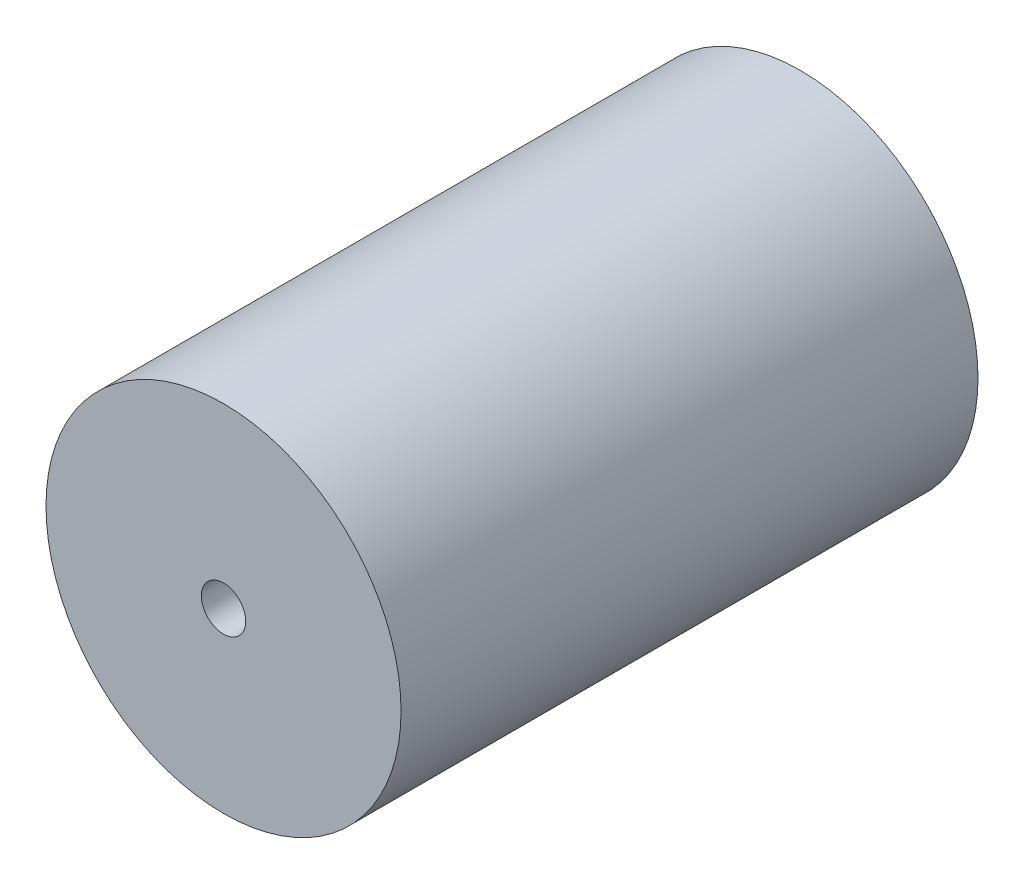
ISO-10303-21;
HEADER;
FILE_DESCRIPTION(('STEP AP214'),'2;1');
FILE_NAME('part.step','',(''),(''),'','','');
FILE_SCHEMA(('AUTOMOTIVE_DESIGN { 1 0 10303 214 1 1 1 1 }'));
ENDSEC;
DATA;
#1=APPLICATION_CONTEXT('core data for automotive mechanical design processes');
#2=APPLICATION_PROTOCOL_DEFINITION('international standard','automotive_design',2000,#1);
#3=PRODUCT_CONTEXT('',#1,'mechanical');
#4=PRODUCT('Part','Part','',(#3));
#5=PRODUCT_RELATED_PRODUCT_CATEGORY('part','',(#4));
#6=PRODUCT_DEFINITION_FORMATION('','',#4);
#7=PRODUCT_DEFINITION_CONTEXT('part definition',#1,'design');
#8=PRODUCT_DEFINITION('design','',#6,#7);
#9=PRODUCT_DEFINITION_SHAPE('','',#8);
#10=(LENGTH_UNIT() NAMED_UNIT(*) SI_UNIT(.MILLI.,.METRE.));
#11=(NAMED_UNIT(*) PLANE_ANGLE_UNIT() SI_UNIT($,.RADIAN.));
#12=(NAMED_UNIT(*) SI_UNIT($,.STERADIAN.) SOLID_ANGLE_UNIT());
#13=UNCERTAINTY_MEASURE_WITH_UNIT(LENGTH_MEASURE(1.E-05),#10,'distance_accuracy_value','');
#14=(GEOMETRIC_REPRESENTATION_CONTEXT(3) GLOBAL_UNCERTAINTY_ASSIGNED_CONTEXT((#13)) GLOBAL_UNIT_ASSIGNED_CONTEXT((#10,
#11,#12)) REPRESENTATION_CONTEXT('',''));
#15=CARTESIAN_POINT('',(0.,0.,0.));
#16=DIRECTION('',(0.,0.,1.));
#17=DIRECTION('',(1.,0.,0.));
#18=AXIS2_PLACEMENT_3D('',#15,#16,#17);
#19=CARTESIAN_POINT('',(0.,0.,0.));
#20=DIRECTION('',(0.,0.,1.));
#21=DIRECTION('',(1.,0.,0.));
#22=AXIS2_PLACEMENT_3D('',#19,#20,#21);
#23=PLANE('',#22);
#24=CARTESIAN_POINT('',(0.,0.,0.));
#25=DIRECTION('',(0.,0.,1.));
#26=DIRECTION('',(1.,0.,0.));
#27=AXIS2_PLACEMENT_3D('',#24,#25,#26);
#28=CIRCLE('',#27,4.);
#29=CARTESIAN_POINT('',(4.,0.,0.));
#30=VERTEX_POINT('',#29);
#31=EDGE_CURVE('E10',#30,#30,#28,.T.);
#32=ORIENTED_EDGE('',*,*,#31,.F.);
#33=EDGE_LOOP('',(#32));
#34=FACE_BOUND('',#33,.T.);
#35=CARTESIAN_POINT('',(0.,0.,0.));
#36=DIRECTION('',(0.,0.,1.));
#37=DIRECTION('',(1.,0.,0.));
#38=AXIS2_PLACEMENT_3D('',#35,#36,#37);
#39=CIRCLE('',#38,2.6);
#40=CARTESIAN_POINT('',(2.6,0.,0.));
#41=VERTEX_POINT('',#40);
#42=EDGE_CURVE('E38',#41,#41,#39,.T.);
#43=ORIENTED_EDGE('',*,*,#42,.T.);
#44=EDGE_LOOP('',(#43));
#45=FACE_BOUND('',#44,.T.);
#46=ADVANCED_FACE('F31',(#34,#45),#23,.F.);
#47=CARTESIAN_POINT('',(0.,0.,11.));
#48=DIRECTION('',(0.,0.,-1.));
#49=DIRECTION('',(-1.,0.,0.));
#50=AXIS2_PLACEMENT_3D('',#47,#48,#49);
#51=CYLINDRICAL_SURFACE('',#50,4.);
#52=ORIENTED_EDGE('',*,*,#31,.T.);
#53=EDGE_LOOP('',(#52));
#54=FACE_BOUND('',#53,.T.);
#55=CARTESIAN_POINT('',(0.,0.,13.));
#56=DIRECTION('',(0.,0.,1.));
#57=DIRECTION('',(1.,0.,0.));
#58=AXIS2_PLACEMENT_3D('',#55,#56,#57);
#59=CIRCLE('',#58,4.);
#60=CARTESIAN_POINT('',(4.,0.,13.));
#61=VERTEX_POINT('',#60);
#62=EDGE_CURVE('E46',#61,#61,#59,.T.);
#63=ORIENTED_EDGE('',*,*,#62,.F.);
#64=EDGE_LOOP('',(#63));
#65=FACE_BOUND('',#64,.T.);
#66=ADVANCED_FACE('F33',(#54,#65),#51,.T.);
#67=CARTESIAN_POINT('',(0.,0.,11.));
#68=DIRECTION('',(0.,0.,-1.));
#69=DIRECTION('',(-1.,0.,0.));
#70=AXIS2_PLACEMENT_3D('',#67,#68,#69);
#71=CYLINDRICAL_SURFACE('',#70,2.6);
#72=CARTESIAN_POINT('',(0.,0.,11.));
#73=DIRECTION('',(0.,0.,1.));
#74=DIRECTION('',(1.,0.,0.));
#75=AXIS2_PLACEMENT_3D('',#72,#73,#74);
#76=CIRCLE('',#75,2.6);
#77=CARTESIAN_POINT('',(2.6,0.,11.));
#78=VERTEX_POINT('',#77);
#79=EDGE_CURVE('E42',#78,#78,#76,.T.);
#80=ORIENTED_EDGE('',*,*,#79,.T.);
#81=EDGE_LOOP('',(#80));
#82=FACE_BOUND('',#81,.T.);
#83=ORIENTED_EDGE('',*,*,#42,.F.);
#84=EDGE_LOOP('',(#83));
#85=FACE_BOUND('',#84,.T.);
#86=ADVANCED_FACE('F74',(#82,#85),#71,.F.);
#87=CARTESIAN_POINT('',(0.,0.,11.));
#88=DIRECTION('',(0.,0.,1.));
#89=DIRECTION('',(1.,0.,0.));
#90=AXIS2_PLACEMENT_3D('',#87,#88,#89);
#91=PLANE('',#90);
#92=ORIENTED_EDGE('',*,*,#79,.F.);
#93=EDGE_LOOP('',(#92));
#94=FACE_BOUND('',#93,.T.);
#95=ADVANCED_FACE('F69',(#94),#91,.F.);
#96=CARTESIAN_POINT('',(0.,0.,13.));
#97=DIRECTION('',(0.,0.,1.));
#98=DIRECTION('',(1.,0.,0.));
#99=AXIS2_PLACEMENT_3D('',#96,#97,#98);
#100=PLANE('',#99);
#101=CARTESIAN_POINT('',(0.,0.,13.));
#102=DIRECTION('',(0.,0.,1.));
#103=DIRECTION('',(1.,0.,0.));
#104=AXIS2_PLACEMENT_3D('',#101,#102,#103);
#105=CIRCLE('',#104,0.5);
#106=CARTESIAN_POINT('',(0.5,0.,13.));
#107=VERTEX_POINT('',#106);
#108=EDGE_CURVE('E52',#107,#107,#105,.T.);
#109=ORIENTED_EDGE('',*,*,#108,.F.);
#110=EDGE_LOOP('',(#109));
#111=FACE_BOUND('',#110,.T.);
#112=ORIENTED_EDGE('',*,*,#62,.T.);
#113=EDGE_LOOP('',(#112));
#114=FACE_BOUND('',#113,.T.);
#115=ADVANCED_FACE('F63',(#111,#114),#100,.T.);
#116=CARTESIAN_POINT('',(0.,0.,12.));
#117=DIRECTION('',(0.,0.,1.));
#118=DIRECTION('',(1.,0.,0.));
#119=AXIS2_PLACEMENT_3D('',#116,#117,#118);
#120=CYLINDRICAL_SURFACE('',#119,0.5);
#121=CARTESIAN_POINT('',(0.,0.,12.));
#122=DIRECTION('',(0.,0.,1.));
#123=DIRECTION('',(1.,0.,0.));
#124=AXIS2_PLACEMENT_3D('',#121,#122,#123);
#125=CIRCLE('',#124,0.5);
#126=CARTESIAN_POINT('',(0.5,0.,12.));
#127=VERTEX_POINT('',#126);
#128=EDGE_CURVE('E51',#127,#127,#125,.T.);
#129=ORIENTED_EDGE('',*,*,#128,.F.);
#130=EDGE_LOOP('',(#129));
#131=FACE_BOUND('',#130,.T.);
#132=ORIENTED_EDGE('',*,*,#108,.T.);
#133=EDGE_LOOP('',(#132));
#134=FACE_BOUND('',#133,.T.);
#135=ADVANCED_FACE('F60',(#131,#134),#120,.F.);
#136=CARTESIAN_POINT('',(0.,0.,12.));
#137=DIRECTION('',(0.,0.,1.));
#138=DIRECTION('',(1.,0.,0.));
#139=AXIS2_PLACEMENT_3D('',#136,#137,#138);
#140=PLANE('',#139);
#141=ORIENTED_EDGE('',*,*,#128,.T.);
#142=EDGE_LOOP('',(#141));
#143=FACE_BOUND('',#142,.T.);
#144=ADVANCED_FACE('F58',(#143),#140,.T.);
#145=CLOSED_SHELL('',(#46,#66,#86,#95,#115,#135,#144));
#146=MANIFOLD_SOLID_BREP('B2',#145);
#147=ADVANCED_BREP_SHAPE_REPRESENTATION('',(#18,#146),#14);
#148=SHAPE_DEFINITION_REPRESENTATION(#9,#147);
ENDSEC;
END-ISO-10303-21;
